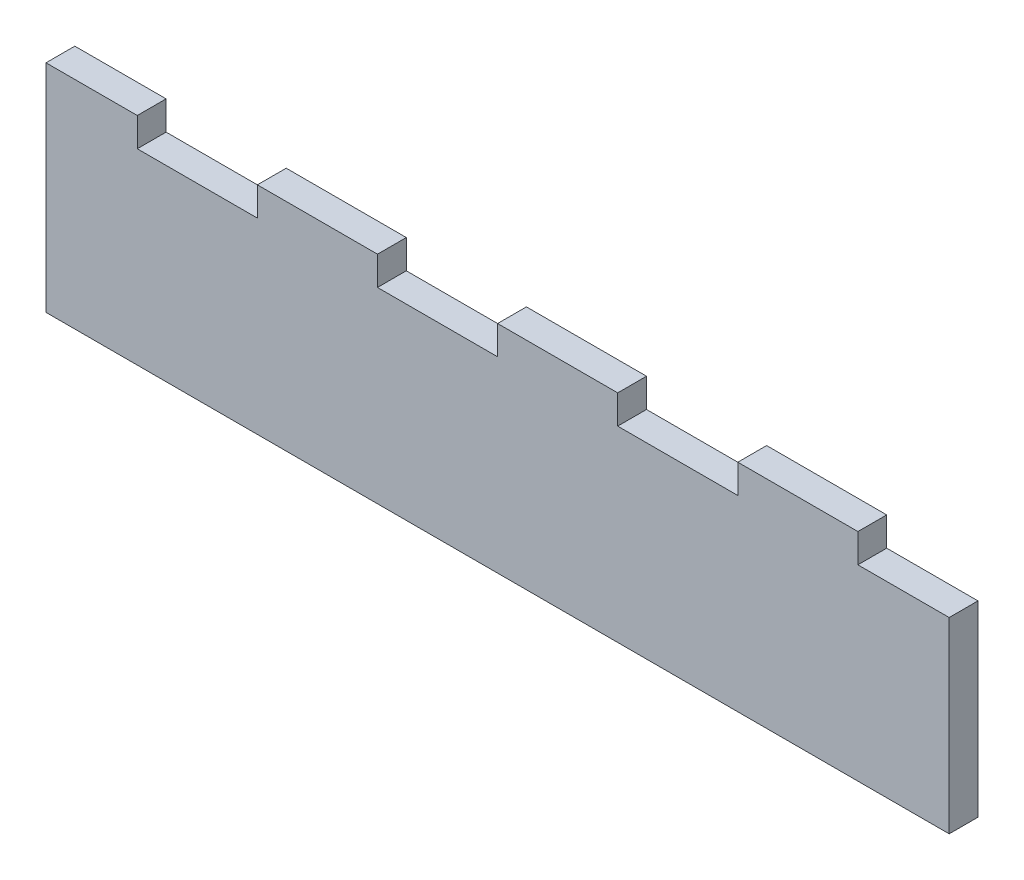
ISO-10303-21;
HEADER;
FILE_DESCRIPTION(('STEP AP214'),'2;1');
FILE_NAME('part.step','',(''),(''),'','','');
FILE_SCHEMA(('AUTOMOTIVE_DESIGN { 1 0 10303 214 1 1 1 1 }'));
ENDSEC;
DATA;
#1=APPLICATION_CONTEXT('core data for automotive mechanical design processes');
#2=APPLICATION_PROTOCOL_DEFINITION('international standard','automotive_design',2000,#1);
#3=PRODUCT_CONTEXT('',#1,'mechanical');
#4=PRODUCT('Part','Part','',(#3));
#5=PRODUCT_RELATED_PRODUCT_CATEGORY('part','',(#4));
#6=PRODUCT_DEFINITION_FORMATION('','',#4);
#7=PRODUCT_DEFINITION_CONTEXT('part definition',#1,'design');
#8=PRODUCT_DEFINITION('design','',#6,#7);
#9=PRODUCT_DEFINITION_SHAPE('','',#8);
#10=(LENGTH_UNIT() NAMED_UNIT(*) SI_UNIT(.MILLI.,.METRE.));
#11=(NAMED_UNIT(*) PLANE_ANGLE_UNIT() SI_UNIT($,.RADIAN.));
#12=(NAMED_UNIT(*) SI_UNIT($,.STERADIAN.) SOLID_ANGLE_UNIT());
#13=UNCERTAINTY_MEASURE_WITH_UNIT(LENGTH_MEASURE(1.E-05),#10,'distance_accuracy_value','');
#14=(GEOMETRIC_REPRESENTATION_CONTEXT(3) GLOBAL_UNCERTAINTY_ASSIGNED_CONTEXT((#13)) GLOBAL_UNIT_ASSIGNED_CONTEXT((#10,
#11,#12)) REPRESENTATION_CONTEXT('',''));
#15=CARTESIAN_POINT('',(0.,0.,0.));
#16=DIRECTION('',(0.,0.,1.));
#17=DIRECTION('',(1.,0.,0.));
#18=AXIS2_PLACEMENT_3D('',#15,#16,#17);
#19=CARTESIAN_POINT('',(0.,39.,6.));
#20=DIRECTION('',(0.,1.,0.));
#21=DIRECTION('',(0.,0.,1.));
#22=AXIS2_PLACEMENT_3D('',#19,#20,#21);
#23=PLANE('',#22);
#24=DIRECTION('',(1.,0.,0.));
#25=VECTOR('',#24,1.);
#26=CARTESIAN_POINT('',(0.,39.,0.));
#27=LINE('',#26,#25);
#28=CARTESIAN_POINT('',(169.,39.,0.));
#29=VERTEX_POINT('',#28);
#30=CARTESIAN_POINT('',(188.,39.,0.));
#31=VERTEX_POINT('',#30);
#32=EDGE_CURVE('E201',#29,#31,#27,.T.);
#33=ORIENTED_EDGE('',*,*,#32,.F.);
#34=DIRECTION('',(0.,0.,-1.));
#35=VECTOR('',#34,1.);
#36=CARTESIAN_POINT('',(169.,39.,6.));
#37=LINE('',#36,#35);
#38=CARTESIAN_POINT('',(169.,39.,6.));
#39=VERTEX_POINT('',#38);
#40=EDGE_CURVE('E11',#39,#29,#37,.T.);
#41=ORIENTED_EDGE('',*,*,#40,.F.);
#42=DIRECTION('',(1.,0.,0.));
#43=VECTOR('',#42,1.);
#44=CARTESIAN_POINT('',(0.,39.,6.));
#45=LINE('',#44,#43);
#46=CARTESIAN_POINT('',(188.,39.,6.));
#47=VERTEX_POINT('',#46);
#48=EDGE_CURVE('E268',#39,#47,#45,.T.);
#49=ORIENTED_EDGE('',*,*,#48,.T.);
#50=DIRECTION('',(0.,0.,-1.));
#51=VECTOR('',#50,1.);
#52=CARTESIAN_POINT('',(188.,39.,6.));
#53=LINE('',#52,#51);
#54=EDGE_CURVE('E122',#47,#31,#53,.T.);
#55=ORIENTED_EDGE('',*,*,#54,.T.);
#56=EDGE_LOOP('',(#33,#41,#49,#55));
#57=FACE_BOUND('',#56,.T.);
#58=ADVANCED_FACE('F41',(#57),#23,.T.);
#59=CARTESIAN_POINT('',(169.,0.,6.));
#60=DIRECTION('',(-1.,0.,0.));
#61=DIRECTION('',(0.,0.,1.));
#62=AXIS2_PLACEMENT_3D('',#59,#60,#61);
#63=PLANE('',#62);
#64=DIRECTION('',(0.,1.,0.));
#65=VECTOR('',#64,1.);
#66=CARTESIAN_POINT('',(169.,0.,0.));
#67=LINE('',#66,#65);
#68=CARTESIAN_POINT('',(169.,45.,0.));
#69=VERTEX_POINT('',#68);
#70=EDGE_CURVE('E205',#29,#69,#67,.T.);
#71=ORIENTED_EDGE('',*,*,#70,.T.);
#72=DIRECTION('',(0.,0.,-1.));
#73=VECTOR('',#72,1.);
#74=CARTESIAN_POINT('',(169.,45.,6.));
#75=LINE('',#74,#73);
#76=CARTESIAN_POINT('',(169.,45.,6.));
#77=VERTEX_POINT('',#76);
#78=EDGE_CURVE('E50',#77,#69,#75,.T.);
#79=ORIENTED_EDGE('',*,*,#78,.F.);
#80=DIRECTION('',(0.,1.,0.));
#81=VECTOR('',#80,1.);
#82=CARTESIAN_POINT('',(169.,0.,6.));
#83=LINE('',#82,#81);
#84=EDGE_CURVE('E333',#39,#77,#83,.T.);
#85=ORIENTED_EDGE('',*,*,#84,.F.);
#86=ORIENTED_EDGE('',*,*,#40,.T.);
#87=EDGE_LOOP('',(#71,#79,#85,#86));
#88=FACE_BOUND('',#87,.T.);
#89=ADVANCED_FACE('F320',(#88),#63,.F.);
#90=CARTESIAN_POINT('',(0.,45.,6.));
#91=DIRECTION('',(0.,1.,0.));
#92=DIRECTION('',(0.,0.,1.));
#93=AXIS2_PLACEMENT_3D('',#90,#91,#92);
#94=PLANE('',#93);
#95=DIRECTION('',(1.,0.,0.));
#96=VECTOR('',#95,1.);
#97=CARTESIAN_POINT('',(0.,45.,0.));
#98=LINE('',#97,#96);
#99=CARTESIAN_POINT('',(144.,45.,0.));
#100=VERTEX_POINT('',#99);
#101=EDGE_CURVE('E209',#100,#69,#98,.T.);
#102=ORIENTED_EDGE('',*,*,#101,.F.);
#103=DIRECTION('',(0.,0.,-1.));
#104=VECTOR('',#103,1.);
#105=CARTESIAN_POINT('',(144.,45.,6.));
#106=LINE('',#105,#104);
#107=CARTESIAN_POINT('',(144.,45.,6.));
#108=VERTEX_POINT('',#107);
#109=EDGE_CURVE('E308',#108,#100,#106,.T.);
#110=ORIENTED_EDGE('',*,*,#109,.F.);
#111=DIRECTION('',(1.,0.,0.));
#112=VECTOR('',#111,1.);
#113=CARTESIAN_POINT('',(0.,45.,6.));
#114=LINE('',#113,#112);
#115=EDGE_CURVE('E317',#108,#77,#114,.T.);
#116=ORIENTED_EDGE('',*,*,#115,.T.);
#117=ORIENTED_EDGE('',*,*,#78,.T.);
#118=EDGE_LOOP('',(#102,#110,#116,#117));
#119=FACE_BOUND('',#118,.T.);
#120=ADVANCED_FACE('F315',(#119),#94,.T.);
#121=CARTESIAN_POINT('',(144.,0.,6.));
#122=DIRECTION('',(-1.,0.,0.));
#123=DIRECTION('',(0.,0.,1.));
#124=AXIS2_PLACEMENT_3D('',#121,#122,#123);
#125=PLANE('',#124);
#126=DIRECTION('',(0.,1.,0.));
#127=VECTOR('',#126,1.);
#128=CARTESIAN_POINT('',(144.,0.,0.));
#129=LINE('',#128,#127);
#130=CARTESIAN_POINT('',(144.,39.,0.));
#131=VERTEX_POINT('',#130);
#132=EDGE_CURVE('E213',#131,#100,#129,.T.);
#133=ORIENTED_EDGE('',*,*,#132,.F.);
#134=DIRECTION('',(0.,0.,-1.));
#135=VECTOR('',#134,1.);
#136=CARTESIAN_POINT('',(144.,39.,6.));
#137=LINE('',#136,#135);
#138=CARTESIAN_POINT('',(144.,39.,6.));
#139=VERTEX_POINT('',#138);
#140=EDGE_CURVE('E305',#139,#131,#137,.T.);
#141=ORIENTED_EDGE('',*,*,#140,.F.);
#142=DIRECTION('',(0.,1.,0.));
#143=VECTOR('',#142,1.);
#144=CARTESIAN_POINT('',(144.,0.,6.));
#145=LINE('',#144,#143);
#146=EDGE_CURVE('E330',#139,#108,#145,.T.);
#147=ORIENTED_EDGE('',*,*,#146,.T.);
#148=ORIENTED_EDGE('',*,*,#109,.T.);
#149=EDGE_LOOP('',(#133,#141,#147,#148));
#150=FACE_BOUND('',#149,.T.);
#151=ADVANCED_FACE('F327',(#150),#125,.T.);
#152=CARTESIAN_POINT('',(0.,39.,6.));
#153=DIRECTION('',(0.,1.,0.));
#154=DIRECTION('',(0.,0.,1.));
#155=AXIS2_PLACEMENT_3D('',#152,#153,#154);
#156=PLANE('',#155);
#157=DIRECTION('',(1.,0.,0.));
#158=VECTOR('',#157,1.);
#159=CARTESIAN_POINT('',(0.,39.,0.));
#160=LINE('',#159,#158);
#161=CARTESIAN_POINT('',(119.,39.,0.));
#162=VERTEX_POINT('',#161);
#163=EDGE_CURVE('E217',#162,#131,#160,.T.);
#164=ORIENTED_EDGE('',*,*,#163,.F.);
#165=DIRECTION('',(0.,0.,-1.));
#166=VECTOR('',#165,1.);
#167=CARTESIAN_POINT('',(119.,39.,6.));
#168=LINE('',#167,#166);
#169=CARTESIAN_POINT('',(119.,39.,6.));
#170=VERTEX_POINT('',#169);
#171=EDGE_CURVE('E302',#170,#162,#168,.T.);
#172=ORIENTED_EDGE('',*,*,#171,.F.);
#173=DIRECTION('',(1.,0.,0.));
#174=VECTOR('',#173,1.);
#175=CARTESIAN_POINT('',(0.,39.,6.));
#176=LINE('',#175,#174);
#177=EDGE_CURVE('E338',#170,#139,#176,.T.);
#178=ORIENTED_EDGE('',*,*,#177,.T.);
#179=ORIENTED_EDGE('',*,*,#140,.T.);
#180=EDGE_LOOP('',(#164,#172,#178,#179));
#181=FACE_BOUND('',#180,.T.);
#182=ADVANCED_FACE('F400',(#181),#156,.T.);
#183=CARTESIAN_POINT('',(119.,0.,6.));
#184=DIRECTION('',(-1.,0.,0.));
#185=DIRECTION('',(0.,0.,1.));
#186=AXIS2_PLACEMENT_3D('',#183,#184,#185);
#187=PLANE('',#186);
#188=DIRECTION('',(0.,1.,0.));
#189=VECTOR('',#188,1.);
#190=CARTESIAN_POINT('',(119.,0.,0.));
#191=LINE('',#190,#189);
#192=CARTESIAN_POINT('',(119.,45.,0.));
#193=VERTEX_POINT('',#192);
#194=EDGE_CURVE('E221',#162,#193,#191,.T.);
#195=ORIENTED_EDGE('',*,*,#194,.T.);
#196=DIRECTION('',(0.,0.,-1.));
#197=VECTOR('',#196,1.);
#198=CARTESIAN_POINT('',(119.,45.,6.));
#199=LINE('',#198,#197);
#200=CARTESIAN_POINT('',(119.,45.,6.));
#201=VERTEX_POINT('',#200);
#202=EDGE_CURVE('E299',#201,#193,#199,.T.);
#203=ORIENTED_EDGE('',*,*,#202,.F.);
#204=DIRECTION('',(0.,1.,0.));
#205=VECTOR('',#204,1.);
#206=CARTESIAN_POINT('',(119.,0.,6.));
#207=LINE('',#206,#205);
#208=EDGE_CURVE('E345',#170,#201,#207,.T.);
#209=ORIENTED_EDGE('',*,*,#208,.F.);
#210=ORIENTED_EDGE('',*,*,#171,.T.);
#211=EDGE_LOOP('',(#195,#203,#209,#210));
#212=FACE_BOUND('',#211,.T.);
#213=ADVANCED_FACE('F403',(#212),#187,.F.);
#214=CARTESIAN_POINT('',(0.,45.,6.));
#215=DIRECTION('',(0.,1.,0.));
#216=DIRECTION('',(0.,0.,1.));
#217=AXIS2_PLACEMENT_3D('',#214,#215,#216);
#218=PLANE('',#217);
#219=DIRECTION('',(1.,0.,0.));
#220=VECTOR('',#219,1.);
#221=CARTESIAN_POINT('',(0.,45.,0.));
#222=LINE('',#221,#220);
#223=CARTESIAN_POINT('',(94.,45.,0.));
#224=VERTEX_POINT('',#223);
#225=EDGE_CURVE('E225',#224,#193,#222,.T.);
#226=ORIENTED_EDGE('',*,*,#225,.F.);
#227=DIRECTION('',(0.,0.,-1.));
#228=VECTOR('',#227,1.);
#229=CARTESIAN_POINT('',(94.,45.,6.));
#230=LINE('',#229,#228);
#231=CARTESIAN_POINT('',(94.,45.,6.));
#232=VERTEX_POINT('',#231);
#233=EDGE_CURVE('E296',#232,#224,#230,.T.);
#234=ORIENTED_EDGE('',*,*,#233,.F.);
#235=DIRECTION('',(1.,0.,0.));
#236=VECTOR('',#235,1.);
#237=CARTESIAN_POINT('',(0.,45.,6.));
#238=LINE('',#237,#236);
#239=EDGE_CURVE('E348',#232,#201,#238,.T.);
#240=ORIENTED_EDGE('',*,*,#239,.T.);
#241=ORIENTED_EDGE('',*,*,#202,.T.);
#242=EDGE_LOOP('',(#226,#234,#240,#241));
#243=FACE_BOUND('',#242,.T.);
#244=ADVANCED_FACE('F407',(#243),#218,.T.);
#245=CARTESIAN_POINT('',(94.,0.,6.));
#246=DIRECTION('',(-1.,0.,0.));
#247=DIRECTION('',(0.,0.,1.));
#248=AXIS2_PLACEMENT_3D('',#245,#246,#247);
#249=PLANE('',#248);
#250=DIRECTION('',(0.,1.,0.));
#251=VECTOR('',#250,1.);
#252=CARTESIAN_POINT('',(94.,0.,0.));
#253=LINE('',#252,#251);
#254=CARTESIAN_POINT('',(94.,39.,0.));
#255=VERTEX_POINT('',#254);
#256=EDGE_CURVE('E229',#255,#224,#253,.T.);
#257=ORIENTED_EDGE('',*,*,#256,.F.);
#258=DIRECTION('',(0.,0.,-1.));
#259=VECTOR('',#258,1.);
#260=CARTESIAN_POINT('',(94.,39.,6.));
#261=LINE('',#260,#259);
#262=CARTESIAN_POINT('',(94.,39.,6.));
#263=VERTEX_POINT('',#262);
#264=EDGE_CURVE('E293',#263,#255,#261,.T.);
#265=ORIENTED_EDGE('',*,*,#264,.F.);
#266=DIRECTION('',(0.,1.,0.));
#267=VECTOR('',#266,1.);
#268=CARTESIAN_POINT('',(94.,0.,6.));
#269=LINE('',#268,#267);
#270=EDGE_CURVE('E352',#263,#232,#269,.T.);
#271=ORIENTED_EDGE('',*,*,#270,.T.);
#272=ORIENTED_EDGE('',*,*,#233,.T.);
#273=EDGE_LOOP('',(#257,#265,#271,#272));
#274=FACE_BOUND('',#273,.T.);
#275=ADVANCED_FACE('F411',(#274),#249,.T.);
#276=CARTESIAN_POINT('',(0.,39.,6.));
#277=DIRECTION('',(0.,1.,0.));
#278=DIRECTION('',(0.,0.,1.));
#279=AXIS2_PLACEMENT_3D('',#276,#277,#278);
#280=PLANE('',#279);
#281=DIRECTION('',(1.,0.,0.));
#282=VECTOR('',#281,1.);
#283=CARTESIAN_POINT('',(0.,39.,0.));
#284=LINE('',#283,#282);
#285=CARTESIAN_POINT('',(69.,39.,0.));
#286=VERTEX_POINT('',#285);
#287=EDGE_CURVE('E233',#286,#255,#284,.T.);
#288=ORIENTED_EDGE('',*,*,#287,.F.);
#289=DIRECTION('',(0.,0.,-1.));
#290=VECTOR('',#289,1.);
#291=CARTESIAN_POINT('',(69.,39.,6.));
#292=LINE('',#291,#290);
#293=CARTESIAN_POINT('',(69.,39.,6.));
#294=VERTEX_POINT('',#293);
#295=EDGE_CURVE('E290',#294,#286,#292,.T.);
#296=ORIENTED_EDGE('',*,*,#295,.F.);
#297=DIRECTION('',(1.,0.,0.));
#298=VECTOR('',#297,1.);
#299=CARTESIAN_POINT('',(0.,39.,6.));
#300=LINE('',#299,#298);
#301=EDGE_CURVE('E356',#294,#263,#300,.T.);
#302=ORIENTED_EDGE('',*,*,#301,.T.);
#303=ORIENTED_EDGE('',*,*,#264,.T.);
#304=EDGE_LOOP('',(#288,#296,#302,#303));
#305=FACE_BOUND('',#304,.T.);
#306=ADVANCED_FACE('F415',(#305),#280,.T.);
#307=CARTESIAN_POINT('',(69.,0.,6.));
#308=DIRECTION('',(-1.,0.,0.));
#309=DIRECTION('',(0.,0.,1.));
#310=AXIS2_PLACEMENT_3D('',#307,#308,#309);
#311=PLANE('',#310);
#312=DIRECTION('',(0.,1.,0.));
#313=VECTOR('',#312,1.);
#314=CARTESIAN_POINT('',(69.,0.,0.));
#315=LINE('',#314,#313);
#316=CARTESIAN_POINT('',(69.,45.,0.));
#317=VERTEX_POINT('',#316);
#318=EDGE_CURVE('E237',#286,#317,#315,.T.);
#319=ORIENTED_EDGE('',*,*,#318,.T.);
#320=DIRECTION('',(0.,0.,-1.));
#321=VECTOR('',#320,1.);
#322=CARTESIAN_POINT('',(69.,45.,6.));
#323=LINE('',#322,#321);
#324=CARTESIAN_POINT('',(69.,45.,6.));
#325=VERTEX_POINT('',#324);
#326=EDGE_CURVE('E287',#325,#317,#323,.T.);
#327=ORIENTED_EDGE('',*,*,#326,.F.);
#328=DIRECTION('',(0.,1.,0.));
#329=VECTOR('',#328,1.);
#330=CARTESIAN_POINT('',(69.,0.,6.));
#331=LINE('',#330,#329);
#332=EDGE_CURVE('E360',#294,#325,#331,.T.);
#333=ORIENTED_EDGE('',*,*,#332,.F.);
#334=ORIENTED_EDGE('',*,*,#295,.T.);
#335=EDGE_LOOP('',(#319,#327,#333,#334));
#336=FACE_BOUND('',#335,.T.);
#337=ADVANCED_FACE('F419',(#336),#311,.F.);
#338=CARTESIAN_POINT('',(0.,45.,6.));
#339=DIRECTION('',(0.,1.,0.));
#340=DIRECTION('',(0.,0.,1.));
#341=AXIS2_PLACEMENT_3D('',#338,#339,#340);
#342=PLANE('',#341);
#343=DIRECTION('',(1.,0.,0.));
#344=VECTOR('',#343,1.);
#345=CARTESIAN_POINT('',(0.,45.,0.));
#346=LINE('',#345,#344);
#347=CARTESIAN_POINT('',(44.,45.,0.));
#348=VERTEX_POINT('',#347);
#349=EDGE_CURVE('E241',#348,#317,#346,.T.);
#350=ORIENTED_EDGE('',*,*,#349,.F.);
#351=DIRECTION('',(0.,0.,-1.));
#352=VECTOR('',#351,1.);
#353=CARTESIAN_POINT('',(44.,45.,6.));
#354=LINE('',#353,#352);
#355=CARTESIAN_POINT('',(44.,45.,6.));
#356=VERTEX_POINT('',#355);
#357=EDGE_CURVE('E284',#356,#348,#354,.T.);
#358=ORIENTED_EDGE('',*,*,#357,.F.);
#359=DIRECTION('',(1.,0.,0.));
#360=VECTOR('',#359,1.);
#361=CARTESIAN_POINT('',(0.,45.,6.));
#362=LINE('',#361,#360);
#363=EDGE_CURVE('E363',#356,#325,#362,.T.);
#364=ORIENTED_EDGE('',*,*,#363,.T.);
#365=ORIENTED_EDGE('',*,*,#326,.T.);
#366=EDGE_LOOP('',(#350,#358,#364,#365));
#367=FACE_BOUND('',#366,.T.);
#368=ADVANCED_FACE('F423',(#367),#342,.T.);
#369=CARTESIAN_POINT('',(44.,0.,6.));
#370=DIRECTION('',(-1.,0.,0.));
#371=DIRECTION('',(0.,0.,1.));
#372=AXIS2_PLACEMENT_3D('',#369,#370,#371);
#373=PLANE('',#372);
#374=DIRECTION('',(0.,1.,0.));
#375=VECTOR('',#374,1.);
#376=CARTESIAN_POINT('',(44.,0.,0.));
#377=LINE('',#376,#375);
#378=CARTESIAN_POINT('',(44.,39.,0.));
#379=VERTEX_POINT('',#378);
#380=EDGE_CURVE('E245',#379,#348,#377,.T.);
#381=ORIENTED_EDGE('',*,*,#380,.F.);
#382=DIRECTION('',(0.,0.,-1.));
#383=VECTOR('',#382,1.);
#384=CARTESIAN_POINT('',(44.,39.,6.));
#385=LINE('',#384,#383);
#386=CARTESIAN_POINT('',(44.,39.,6.));
#387=VERTEX_POINT('',#386);
#388=EDGE_CURVE('E281',#387,#379,#385,.T.);
#389=ORIENTED_EDGE('',*,*,#388,.F.);
#390=DIRECTION('',(0.,1.,0.));
#391=VECTOR('',#390,1.);
#392=CARTESIAN_POINT('',(44.,0.,6.));
#393=LINE('',#392,#391);
#394=EDGE_CURVE('E367',#387,#356,#393,.T.);
#395=ORIENTED_EDGE('',*,*,#394,.T.);
#396=ORIENTED_EDGE('',*,*,#357,.T.);
#397=EDGE_LOOP('',(#381,#389,#395,#396));
#398=FACE_BOUND('',#397,.T.);
#399=ADVANCED_FACE('F427',(#398),#373,.T.);
#400=CARTESIAN_POINT('',(0.,39.,6.));
#401=DIRECTION('',(0.,1.,0.));
#402=DIRECTION('',(0.,0.,1.));
#403=AXIS2_PLACEMENT_3D('',#400,#401,#402);
#404=PLANE('',#403);
#405=DIRECTION('',(1.,0.,0.));
#406=VECTOR('',#405,1.);
#407=CARTESIAN_POINT('',(0.,39.,0.));
#408=LINE('',#407,#406);
#409=CARTESIAN_POINT('',(19.,39.,0.));
#410=VERTEX_POINT('',#409);
#411=EDGE_CURVE('E249',#410,#379,#408,.T.);
#412=ORIENTED_EDGE('',*,*,#411,.F.);
#413=DIRECTION('',(0.,0.,-1.));
#414=VECTOR('',#413,1.);
#415=CARTESIAN_POINT('',(19.,39.,6.));
#416=LINE('',#415,#414);
#417=CARTESIAN_POINT('',(19.,39.,6.));
#418=VERTEX_POINT('',#417);
#419=EDGE_CURVE('E278',#418,#410,#416,.T.);
#420=ORIENTED_EDGE('',*,*,#419,.F.);
#421=DIRECTION('',(1.,0.,0.));
#422=VECTOR('',#421,1.);
#423=CARTESIAN_POINT('',(0.,39.,6.));
#424=LINE('',#423,#422);
#425=EDGE_CURVE('E371',#418,#387,#424,.T.);
#426=ORIENTED_EDGE('',*,*,#425,.T.);
#427=ORIENTED_EDGE('',*,*,#388,.T.);
#428=EDGE_LOOP('',(#412,#420,#426,#427));
#429=FACE_BOUND('',#428,.T.);
#430=ADVANCED_FACE('F431',(#429),#404,.T.);
#431=CARTESIAN_POINT('',(19.,0.,6.));
#432=DIRECTION('',(-1.,0.,0.));
#433=DIRECTION('',(0.,0.,1.));
#434=AXIS2_PLACEMENT_3D('',#431,#432,#433);
#435=PLANE('',#434);
#436=DIRECTION('',(0.,1.,0.));
#437=VECTOR('',#436,1.);
#438=CARTESIAN_POINT('',(19.,0.,0.));
#439=LINE('',#438,#437);
#440=CARTESIAN_POINT('',(19.,45.,0.));
#441=VERTEX_POINT('',#440);
#442=EDGE_CURVE('E253',#410,#441,#439,.T.);
#443=ORIENTED_EDGE('',*,*,#442,.T.);
#444=DIRECTION('',(0.,0.,-1.));
#445=VECTOR('',#444,1.);
#446=CARTESIAN_POINT('',(19.,45.,6.));
#447=LINE('',#446,#445);
#448=CARTESIAN_POINT('',(19.,45.,6.));
#449=VERTEX_POINT('',#448);
#450=EDGE_CURVE('E275',#449,#441,#447,.T.);
#451=ORIENTED_EDGE('',*,*,#450,.F.);
#452=DIRECTION('',(0.,1.,0.));
#453=VECTOR('',#452,1.);
#454=CARTESIAN_POINT('',(19.,0.,6.));
#455=LINE('',#454,#453);
#456=EDGE_CURVE('E195',#418,#449,#455,.T.);
#457=ORIENTED_EDGE('',*,*,#456,.F.);
#458=ORIENTED_EDGE('',*,*,#419,.T.);
#459=EDGE_LOOP('',(#443,#451,#457,#458));
#460=FACE_BOUND('',#459,.T.);
#461=ADVANCED_FACE('F380',(#460),#435,.F.);
#462=CARTESIAN_POINT('',(0.,45.,6.));
#463=DIRECTION('',(0.,1.,0.));
#464=DIRECTION('',(0.,0.,1.));
#465=AXIS2_PLACEMENT_3D('',#462,#463,#464);
#466=PLANE('',#465);
#467=DIRECTION('',(1.,0.,0.));
#468=VECTOR('',#467,1.);
#469=CARTESIAN_POINT('',(0.,45.,0.));
#470=LINE('',#469,#468);
#471=CARTESIAN_POINT('',(0.,45.,0.));
#472=VERTEX_POINT('',#471);
#473=EDGE_CURVE('E257',#472,#441,#470,.T.);
#474=ORIENTED_EDGE('',*,*,#473,.F.);
#475=DIRECTION('',(0.,0.,-1.));
#476=VECTOR('',#475,1.);
#477=CARTESIAN_POINT('',(0.,45.,6.));
#478=LINE('',#477,#476);
#479=CARTESIAN_POINT('',(0.,45.,6.));
#480=VERTEX_POINT('',#479);
#481=EDGE_CURVE('E181',#480,#472,#478,.T.);
#482=ORIENTED_EDGE('',*,*,#481,.F.);
#483=DIRECTION('',(1.,0.,0.));
#484=VECTOR('',#483,1.);
#485=CARTESIAN_POINT('',(0.,45.,6.));
#486=LINE('',#485,#484);
#487=EDGE_CURVE('E191',#480,#449,#486,.T.);
#488=ORIENTED_EDGE('',*,*,#487,.T.);
#489=ORIENTED_EDGE('',*,*,#450,.T.);
#490=EDGE_LOOP('',(#474,#482,#488,#489));
#491=FACE_BOUND('',#490,.T.);
#492=ADVANCED_FACE('F384',(#491),#466,.T.);
#493=CARTESIAN_POINT('',(0.,0.,6.));
#494=DIRECTION('',(-1.,0.,0.));
#495=DIRECTION('',(0.,0.,1.));
#496=AXIS2_PLACEMENT_3D('',#493,#494,#495);
#497=PLANE('',#496);
#498=DIRECTION('',(0.,1.,0.));
#499=VECTOR('',#498,1.);
#500=CARTESIAN_POINT('',(0.,0.,0.));
#501=LINE('',#500,#499);
#502=CARTESIAN_POINT('',(0.,0.,0.));
#503=VERTEX_POINT('',#502);
#504=EDGE_CURVE('E179',#503,#472,#501,.T.);
#505=ORIENTED_EDGE('',*,*,#504,.F.);
#506=DIRECTION('',(0.,0.,-1.));
#507=VECTOR('',#506,1.);
#508=CARTESIAN_POINT('',(0.,0.,6.));
#509=LINE('',#508,#507);
#510=CARTESIAN_POINT('',(0.,0.,6.));
#511=VERTEX_POINT('',#510);
#512=EDGE_CURVE('E173',#511,#503,#509,.T.);
#513=ORIENTED_EDGE('',*,*,#512,.F.);
#514=DIRECTION('',(0.,1.,0.));
#515=VECTOR('',#514,1.);
#516=CARTESIAN_POINT('',(0.,0.,6.));
#517=LINE('',#516,#515);
#518=EDGE_CURVE('E177',#511,#480,#517,.T.);
#519=ORIENTED_EDGE('',*,*,#518,.T.);
#520=ORIENTED_EDGE('',*,*,#481,.T.);
#521=EDGE_LOOP('',(#505,#513,#519,#520));
#522=FACE_BOUND('',#521,.T.);
#523=ADVANCED_FACE('F175',(#522),#497,.T.);
#524=CARTESIAN_POINT('',(0.,0.,6.));
#525=DIRECTION('',(0.,1.,0.));
#526=DIRECTION('',(0.,0.,1.));
#527=AXIS2_PLACEMENT_3D('',#524,#525,#526);
#528=PLANE('',#527);
#529=DIRECTION('',(1.,0.,0.));
#530=VECTOR('',#529,1.);
#531=CARTESIAN_POINT('',(0.,0.,0.));
#532=LINE('',#531,#530);
#533=CARTESIAN_POINT('',(188.,0.,0.));
#534=VERTEX_POINT('',#533);
#535=EDGE_CURVE('E115',#503,#534,#532,.T.);
#536=ORIENTED_EDGE('',*,*,#535,.T.);
#537=DIRECTION('',(0.,0.,-1.));
#538=VECTOR('',#537,1.);
#539=CARTESIAN_POINT('',(188.,0.,6.));
#540=LINE('',#539,#538);
#541=CARTESIAN_POINT('',(188.,0.,6.));
#542=VERTEX_POINT('',#541);
#543=EDGE_CURVE('E182',#542,#534,#540,.T.);
#544=ORIENTED_EDGE('',*,*,#543,.F.);
#545=DIRECTION('',(1.,0.,0.));
#546=VECTOR('',#545,1.);
#547=CARTESIAN_POINT('',(0.,0.,6.));
#548=LINE('',#547,#546);
#549=EDGE_CURVE('E184',#511,#542,#548,.T.);
#550=ORIENTED_EDGE('',*,*,#549,.F.);
#551=ORIENTED_EDGE('',*,*,#512,.T.);
#552=EDGE_LOOP('',(#536,#544,#550,#551));
#553=FACE_BOUND('',#552,.T.);
#554=ADVANCED_FACE('F185',(#553),#528,.F.);
#555=CARTESIAN_POINT('',(188.,0.,6.));
#556=DIRECTION('',(-1.,0.,0.));
#557=DIRECTION('',(0.,0.,1.));
#558=AXIS2_PLACEMENT_3D('',#555,#556,#557);
#559=PLANE('',#558);
#560=DIRECTION('',(0.,1.,0.));
#561=VECTOR('',#560,1.);
#562=CARTESIAN_POINT('',(188.,0.,0.));
#563=LINE('',#562,#561);
#564=EDGE_CURVE('E265',#534,#31,#563,.T.);
#565=ORIENTED_EDGE('',*,*,#564,.T.);
#566=ORIENTED_EDGE('',*,*,#54,.F.);
#567=DIRECTION('',(0.,1.,0.));
#568=VECTOR('',#567,1.);
#569=CARTESIAN_POINT('',(188.,0.,6.));
#570=LINE('',#569,#568);
#571=EDGE_CURVE('E58',#542,#47,#570,.T.);
#572=ORIENTED_EDGE('',*,*,#571,.F.);
#573=ORIENTED_EDGE('',*,*,#543,.T.);
#574=EDGE_LOOP('',(#565,#566,#572,#573));
#575=FACE_BOUND('',#574,.T.);
#576=ADVANCED_FACE('F387',(#575),#559,.F.);
#577=CARTESIAN_POINT('',(0.,0.,6.));
#578=DIRECTION('',(0.,0.,1.));
#579=DIRECTION('',(1.,0.,0.));
#580=AXIS2_PLACEMENT_3D('',#577,#578,#579);
#581=PLANE('',#580);
#582=ORIENTED_EDGE('',*,*,#48,.F.);
#583=ORIENTED_EDGE('',*,*,#84,.T.);
#584=ORIENTED_EDGE('',*,*,#115,.F.);
#585=ORIENTED_EDGE('',*,*,#146,.F.);
#586=ORIENTED_EDGE('',*,*,#177,.F.);
#587=ORIENTED_EDGE('',*,*,#208,.T.);
#588=ORIENTED_EDGE('',*,*,#239,.F.);
#589=ORIENTED_EDGE('',*,*,#270,.F.);
#590=ORIENTED_EDGE('',*,*,#301,.F.);
#591=ORIENTED_EDGE('',*,*,#332,.T.);
#592=ORIENTED_EDGE('',*,*,#363,.F.);
#593=ORIENTED_EDGE('',*,*,#394,.F.);
#594=ORIENTED_EDGE('',*,*,#425,.F.);
#595=ORIENTED_EDGE('',*,*,#456,.T.);
#596=ORIENTED_EDGE('',*,*,#487,.F.);
#597=ORIENTED_EDGE('',*,*,#518,.F.);
#598=ORIENTED_EDGE('',*,*,#549,.T.);
#599=ORIENTED_EDGE('',*,*,#571,.T.);
#600=EDGE_LOOP('',(#582,#583,#584,#585,#586,#587,#588,#589,#590,#591,#592,#593,#594,#595,#596,
#597,#598,#599));
#601=FACE_BOUND('',#600,.T.);
#602=ADVANCED_FACE('F189',(#601),#581,.T.);
#603=CARTESIAN_POINT('',(0.,0.,0.));
#604=DIRECTION('',(0.,0.,1.));
#605=DIRECTION('',(1.,0.,0.));
#606=AXIS2_PLACEMENT_3D('',#603,#604,#605);
#607=PLANE('',#606);
#608=ORIENTED_EDGE('',*,*,#32,.T.);
#609=ORIENTED_EDGE('',*,*,#564,.F.);
#610=ORIENTED_EDGE('',*,*,#535,.F.);
#611=ORIENTED_EDGE('',*,*,#504,.T.);
#612=ORIENTED_EDGE('',*,*,#473,.T.);
#613=ORIENTED_EDGE('',*,*,#442,.F.);
#614=ORIENTED_EDGE('',*,*,#411,.T.);
#615=ORIENTED_EDGE('',*,*,#380,.T.);
#616=ORIENTED_EDGE('',*,*,#349,.T.);
#617=ORIENTED_EDGE('',*,*,#318,.F.);
#618=ORIENTED_EDGE('',*,*,#287,.T.);
#619=ORIENTED_EDGE('',*,*,#256,.T.);
#620=ORIENTED_EDGE('',*,*,#225,.T.);
#621=ORIENTED_EDGE('',*,*,#194,.F.);
#622=ORIENTED_EDGE('',*,*,#163,.T.);
#623=ORIENTED_EDGE('',*,*,#132,.T.);
#624=ORIENTED_EDGE('',*,*,#101,.T.);
#625=ORIENTED_EDGE('',*,*,#70,.F.);
#626=EDGE_LOOP('',(#608,#609,#610,#611,#612,#613,#614,#615,#616,#617,#618,#619,#620,#621,#622,
#623,#624,#625));
#627=FACE_BOUND('',#626,.T.);
#628=ADVANCED_FACE('F322',(#627),#607,.F.);
#629=CLOSED_SHELL('',(#58,#89,#120,#151,#182,#213,#244,#275,#306,#337,#368,#399,#430,#461,#492,
#523,#554,#576,#602,#628));
#630=MANIFOLD_SOLID_BREP('B2',#629);
#631=ADVANCED_BREP_SHAPE_REPRESENTATION('',(#18,#630),#14);
#632=SHAPE_DEFINITION_REPRESENTATION(#9,#631);
ENDSEC;
END-ISO-10303-21;
